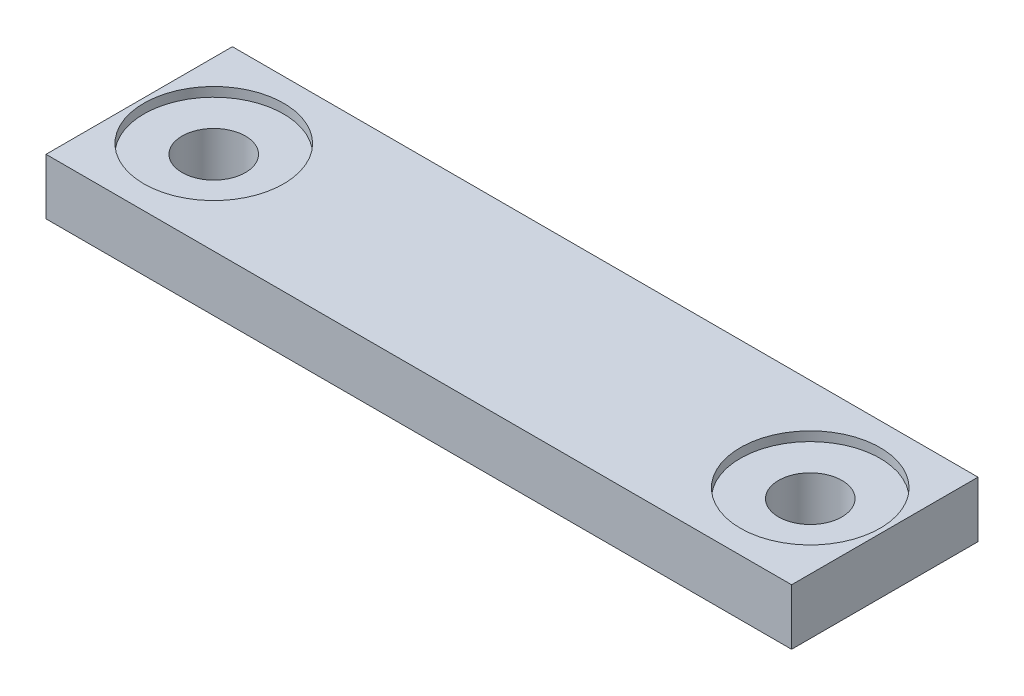
ISO-10303-21;
HEADER;
FILE_DESCRIPTION(('STEP AP214'),'2;1');
FILE_NAME('part.step','',(''),(''),'','','');
FILE_SCHEMA(('AUTOMOTIVE_DESIGN { 1 0 10303 214 1 1 1 1 }'));
ENDSEC;
DATA;
#1=APPLICATION_CONTEXT('core data for automotive mechanical design processes');
#2=APPLICATION_PROTOCOL_DEFINITION('international standard','automotive_design',2000,#1);
#3=PRODUCT_CONTEXT('',#1,'mechanical');
#4=PRODUCT('Part','Part','',(#3));
#5=PRODUCT_RELATED_PRODUCT_CATEGORY('part','',(#4));
#6=PRODUCT_DEFINITION_FORMATION('','',#4);
#7=PRODUCT_DEFINITION_CONTEXT('part definition',#1,'design');
#8=PRODUCT_DEFINITION('design','',#6,#7);
#9=PRODUCT_DEFINITION_SHAPE('','',#8);
#10=(LENGTH_UNIT() NAMED_UNIT(*) SI_UNIT(.MILLI.,.METRE.));
#11=(NAMED_UNIT(*) PLANE_ANGLE_UNIT() SI_UNIT($,.RADIAN.));
#12=(NAMED_UNIT(*) SI_UNIT($,.STERADIAN.) SOLID_ANGLE_UNIT());
#13=UNCERTAINTY_MEASURE_WITH_UNIT(LENGTH_MEASURE(1.E-05),#10,'distance_accuracy_value','');
#14=(GEOMETRIC_REPRESENTATION_CONTEXT(3) GLOBAL_UNCERTAINTY_ASSIGNED_CONTEXT((#13)) GLOBAL_UNIT_ASSIGNED_CONTEXT((#10,
#11,#12)) REPRESENTATION_CONTEXT('',''));
#15=CARTESIAN_POINT('',(0.,0.,0.));
#16=DIRECTION('',(0.,0.,1.));
#17=DIRECTION('',(1.,0.,0.));
#18=AXIS2_PLACEMENT_3D('',#15,#16,#17);
#19=CARTESIAN_POINT('',(0.,-3.,0.));
#20=DIRECTION('',(-1.,0.,0.));
#21=DIRECTION('',(0.,0.,1.));
#22=AXIS2_PLACEMENT_3D('',#19,#20,#21);
#23=PLANE('',#22);
#24=DIRECTION('',(0.,0.,1.));
#25=VECTOR('',#24,1.);
#26=CARTESIAN_POINT('',(0.,0.,0.));
#27=LINE('',#26,#25);
#28=CARTESIAN_POINT('',(0.,0.,0.));
#29=VERTEX_POINT('',#28);
#30=CARTESIAN_POINT('',(0.,0.,10.));
#31=VERTEX_POINT('',#30);
#32=EDGE_CURVE('E110',#29,#31,#27,.T.);
#33=ORIENTED_EDGE('',*,*,#32,.F.);
#34=DIRECTION('',(0.,1.,0.));
#35=VECTOR('',#34,1.);
#36=CARTESIAN_POINT('',(0.,-3.,0.));
#37=LINE('',#36,#35);
#38=CARTESIAN_POINT('',(0.,-3.,0.));
#39=VERTEX_POINT('',#38);
#40=EDGE_CURVE('E11',#39,#29,#37,.T.);
#41=ORIENTED_EDGE('',*,*,#40,.F.);
#42=DIRECTION('',(0.,0.,1.));
#43=VECTOR('',#42,1.);
#44=CARTESIAN_POINT('',(0.,-3.,0.));
#45=LINE('',#44,#43);
#46=CARTESIAN_POINT('',(0.,-3.,10.));
#47=VERTEX_POINT('',#46);
#48=EDGE_CURVE('E101',#39,#47,#45,.T.);
#49=ORIENTED_EDGE('',*,*,#48,.T.);
#50=DIRECTION('',(0.,1.,0.));
#51=VECTOR('',#50,1.);
#52=CARTESIAN_POINT('',(0.,-3.,10.));
#53=LINE('',#52,#51);
#54=EDGE_CURVE('E42',#47,#31,#53,.T.);
#55=ORIENTED_EDGE('',*,*,#54,.T.);
#56=EDGE_LOOP('',(#33,#41,#49,#55));
#57=FACE_BOUND('',#56,.T.);
#58=ADVANCED_FACE('F39',(#57),#23,.T.);
#59=CARTESIAN_POINT('',(0.,-3.,0.));
#60=DIRECTION('',(0.,0.,-1.));
#61=DIRECTION('',(-1.,0.,0.));
#62=AXIS2_PLACEMENT_3D('',#59,#60,#61);
#63=PLANE('',#62);
#64=DIRECTION('',(-1.,0.,0.));
#65=VECTOR('',#64,1.);
#66=CARTESIAN_POINT('',(0.,0.,0.));
#67=LINE('',#66,#65);
#68=CARTESIAN_POINT('',(40.,0.,0.));
#69=VERTEX_POINT('',#68);
#70=EDGE_CURVE('E104',#69,#29,#67,.T.);
#71=ORIENTED_EDGE('',*,*,#70,.F.);
#72=DIRECTION('',(0.,1.,0.));
#73=VECTOR('',#72,1.);
#74=CARTESIAN_POINT('',(40.,-3.,0.));
#75=LINE('',#74,#73);
#76=CARTESIAN_POINT('',(40.,-3.,0.));
#77=VERTEX_POINT('',#76);
#78=EDGE_CURVE('E49',#77,#69,#75,.T.);
#79=ORIENTED_EDGE('',*,*,#78,.F.);
#80=DIRECTION('',(-1.,0.,0.));
#81=VECTOR('',#80,1.);
#82=CARTESIAN_POINT('',(0.,-3.,0.));
#83=LINE('',#82,#81);
#84=EDGE_CURVE('E96',#77,#39,#83,.T.);
#85=ORIENTED_EDGE('',*,*,#84,.T.);
#86=ORIENTED_EDGE('',*,*,#40,.T.);
#87=EDGE_LOOP('',(#71,#79,#85,#86));
#88=FACE_BOUND('',#87,.T.);
#89=ADVANCED_FACE('F127',(#88),#63,.T.);
#90=CARTESIAN_POINT('',(40.,-3.,0.));
#91=DIRECTION('',(1.,0.,0.));
#92=DIRECTION('',(0.,0.,-1.));
#93=AXIS2_PLACEMENT_3D('',#90,#91,#92);
#94=PLANE('',#93);
#95=DIRECTION('',(0.,0.,-1.));
#96=VECTOR('',#95,1.);
#97=CARTESIAN_POINT('',(40.,0.,0.));
#98=LINE('',#97,#96);
#99=CARTESIAN_POINT('',(40.,0.,10.));
#100=VERTEX_POINT('',#99);
#101=EDGE_CURVE('E90',#100,#69,#98,.T.);
#102=ORIENTED_EDGE('',*,*,#101,.F.);
#103=DIRECTION('',(0.,1.,0.));
#104=VECTOR('',#103,1.);
#105=CARTESIAN_POINT('',(40.,-3.,10.));
#106=LINE('',#105,#104);
#107=CARTESIAN_POINT('',(40.,-3.,10.));
#108=VERTEX_POINT('',#107);
#109=EDGE_CURVE('E85',#108,#100,#106,.T.);
#110=ORIENTED_EDGE('',*,*,#109,.F.);
#111=DIRECTION('',(0.,0.,-1.));
#112=VECTOR('',#111,1.);
#113=CARTESIAN_POINT('',(40.,-3.,0.));
#114=LINE('',#113,#112);
#115=EDGE_CURVE('E88',#108,#77,#114,.T.);
#116=ORIENTED_EDGE('',*,*,#115,.T.);
#117=ORIENTED_EDGE('',*,*,#78,.T.);
#118=EDGE_LOOP('',(#102,#110,#116,#117));
#119=FACE_BOUND('',#118,.T.);
#120=ADVANCED_FACE('F87',(#119),#94,.T.);
#121=CARTESIAN_POINT('',(0.,-3.,10.));
#122=DIRECTION('',(0.,0.,1.));
#123=DIRECTION('',(1.,0.,0.));
#124=AXIS2_PLACEMENT_3D('',#121,#122,#123);
#125=PLANE('',#124);
#126=DIRECTION('',(1.,0.,0.));
#127=VECTOR('',#126,1.);
#128=CARTESIAN_POINT('',(0.,0.,10.));
#129=LINE('',#128,#127);
#130=EDGE_CURVE('E114',#31,#100,#129,.T.);
#131=ORIENTED_EDGE('',*,*,#130,.F.);
#132=ORIENTED_EDGE('',*,*,#54,.F.);
#133=DIRECTION('',(1.,0.,0.));
#134=VECTOR('',#133,1.);
#135=CARTESIAN_POINT('',(0.,-3.,10.));
#136=LINE('',#135,#134);
#137=EDGE_CURVE('E95',#47,#108,#136,.T.);
#138=ORIENTED_EDGE('',*,*,#137,.T.);
#139=ORIENTED_EDGE('',*,*,#109,.T.);
#140=EDGE_LOOP('',(#131,#132,#138,#139));
#141=FACE_BOUND('',#140,.T.);
#142=ADVANCED_FACE('F99',(#141),#125,.T.);
#143=CARTESIAN_POINT('',(0.,-3.,0.));
#144=DIRECTION('',(0.,1.,0.));
#145=DIRECTION('',(0.,0.,1.));
#146=AXIS2_PLACEMENT_3D('',#143,#144,#145);
#147=PLANE('',#146);
#148=CARTESIAN_POINT('',(4.,-3.,5.00000000000001));
#149=DIRECTION('',(0.,1.,0.));
#150=DIRECTION('',(0.,0.,1.));
#151=AXIS2_PLACEMENT_3D('',#148,#149,#150);
#152=CIRCLE('',#151,1.7);
#153=CARTESIAN_POINT('',(4.,-3.,6.7));
#154=VERTEX_POINT('',#153);
#155=EDGE_CURVE('E190',#154,#154,#152,.T.);
#156=ORIENTED_EDGE('',*,*,#155,.T.);
#157=EDGE_LOOP('',(#156));
#158=FACE_BOUND('',#157,.T.);
#159=CARTESIAN_POINT('',(36.,-3.,5.));
#160=DIRECTION('',(0.,1.,0.));
#161=DIRECTION('',(0.,0.,1.));
#162=AXIS2_PLACEMENT_3D('',#159,#160,#161);
#163=CIRCLE('',#162,1.7);
#164=CARTESIAN_POINT('',(36.,-3.,6.7));
#165=VERTEX_POINT('',#164);
#166=EDGE_CURVE('E115',#165,#165,#163,.T.);
#167=ORIENTED_EDGE('',*,*,#166,.T.);
#168=EDGE_LOOP('',(#167));
#169=FACE_BOUND('',#168,.T.);
#170=ORIENTED_EDGE('',*,*,#48,.F.);
#171=ORIENTED_EDGE('',*,*,#84,.F.);
#172=ORIENTED_EDGE('',*,*,#115,.F.);
#173=ORIENTED_EDGE('',*,*,#137,.F.);
#174=EDGE_LOOP('',(#170,#171,#172,#173));
#175=FACE_BOUND('',#174,.T.);
#176=ADVANCED_FACE('F94',(#158,#169,#175),#147,.F.);
#177=CARTESIAN_POINT('',(0.,0.,0.));
#178=DIRECTION('',(0.,1.,0.));
#179=DIRECTION('',(0.,0.,1.));
#180=AXIS2_PLACEMENT_3D('',#177,#178,#179);
#181=PLANE('',#180);
#182=CARTESIAN_POINT('',(4.,0.,5.00000000000001));
#183=DIRECTION('',(0.,1.,0.));
#184=DIRECTION('',(0.,0.,1.));
#185=AXIS2_PLACEMENT_3D('',#182,#183,#184);
#186=CIRCLE('',#185,3.75);
#187=CARTESIAN_POINT('',(4.,0.,8.75));
#188=VERTEX_POINT('',#187);
#189=EDGE_CURVE('E180',#188,#188,#186,.T.);
#190=ORIENTED_EDGE('',*,*,#189,.F.);
#191=EDGE_LOOP('',(#190));
#192=FACE_BOUND('',#191,.T.);
#193=CARTESIAN_POINT('',(36.,0.,5.));
#194=DIRECTION('',(0.,1.,0.));
#195=DIRECTION('',(0.,0.,1.));
#196=AXIS2_PLACEMENT_3D('',#193,#194,#195);
#197=CIRCLE('',#196,3.75);
#198=CARTESIAN_POINT('',(36.,0.,8.75));
#199=VERTEX_POINT('',#198);
#200=EDGE_CURVE('E193',#199,#199,#197,.T.);
#201=ORIENTED_EDGE('',*,*,#200,.F.);
#202=EDGE_LOOP('',(#201));
#203=FACE_BOUND('',#202,.T.);
#204=ORIENTED_EDGE('',*,*,#32,.T.);
#205=ORIENTED_EDGE('',*,*,#130,.T.);
#206=ORIENTED_EDGE('',*,*,#101,.T.);
#207=ORIENTED_EDGE('',*,*,#70,.T.);
#208=EDGE_LOOP('',(#204,#205,#206,#207));
#209=FACE_BOUND('',#208,.T.);
#210=ADVANCED_FACE('F126',(#192,#203,#209),#181,.T.);
#211=CARTESIAN_POINT('',(36.,0.,5.));
#212=DIRECTION('',(0.,1.,0.));
#213=DIRECTION('',(0.,0.,1.));
#214=AXIS2_PLACEMENT_3D('',#211,#212,#213);
#215=CYLINDRICAL_SURFACE('',#214,1.7);
#216=ORIENTED_EDGE('',*,*,#166,.F.);
#217=EDGE_LOOP('',(#216));
#218=FACE_BOUND('',#217,.T.);
#219=CARTESIAN_POINT('',(36.,-0.5,5.));
#220=DIRECTION('',(0.,1.,0.));
#221=DIRECTION('',(0.,0.,1.));
#222=AXIS2_PLACEMENT_3D('',#219,#220,#221);
#223=CIRCLE('',#222,1.7);
#224=CARTESIAN_POINT('',(36.,-0.5,6.7));
#225=VERTEX_POINT('',#224);
#226=EDGE_CURVE('E201',#225,#225,#223,.T.);
#227=ORIENTED_EDGE('',*,*,#226,.T.);
#228=EDGE_LOOP('',(#227));
#229=FACE_BOUND('',#228,.T.);
#230=ADVANCED_FACE('F145',(#218,#229),#215,.F.);
#231=CARTESIAN_POINT('',(37.7,-0.5,5.));
#232=DIRECTION('',(0.,-1.,0.));
#233=DIRECTION('',(0.,0.,-1.));
#234=AXIS2_PLACEMENT_3D('',#231,#232,#233);
#235=PLANE('',#234);
#236=ORIENTED_EDGE('',*,*,#226,.F.);
#237=EDGE_LOOP('',(#236));
#238=FACE_BOUND('',#237,.T.);
#239=CARTESIAN_POINT('',(36.,-0.5,5.));
#240=DIRECTION('',(0.,1.,0.));
#241=DIRECTION('',(0.,0.,1.));
#242=AXIS2_PLACEMENT_3D('',#239,#240,#241);
#243=CIRCLE('',#242,3.75);
#244=CARTESIAN_POINT('',(36.,-0.5,8.75));
#245=VERTEX_POINT('',#244);
#246=EDGE_CURVE('E197',#245,#245,#243,.T.);
#247=ORIENTED_EDGE('',*,*,#246,.T.);
#248=EDGE_LOOP('',(#247));
#249=FACE_BOUND('',#248,.T.);
#250=ADVANCED_FACE('F152',(#238,#249),#235,.F.);
#251=CARTESIAN_POINT('',(36.,0.,5.));
#252=DIRECTION('',(0.,1.,0.));
#253=DIRECTION('',(0.,0.,1.));
#254=AXIS2_PLACEMENT_3D('',#251,#252,#253);
#255=CYLINDRICAL_SURFACE('',#254,3.75);
#256=ORIENTED_EDGE('',*,*,#246,.F.);
#257=EDGE_LOOP('',(#256));
#258=FACE_BOUND('',#257,.T.);
#259=ORIENTED_EDGE('',*,*,#200,.T.);
#260=EDGE_LOOP('',(#259));
#261=FACE_BOUND('',#260,.T.);
#262=ADVANCED_FACE('F156',(#258,#261),#255,.F.);
#263=CARTESIAN_POINT('',(4.,0.,5.00000000000001));
#264=DIRECTION('',(0.,1.,0.));
#265=DIRECTION('',(0.,0.,1.));
#266=AXIS2_PLACEMENT_3D('',#263,#264,#265);
#267=CYLINDRICAL_SURFACE('',#266,1.7);
#268=ORIENTED_EDGE('',*,*,#155,.F.);
#269=EDGE_LOOP('',(#268));
#270=FACE_BOUND('',#269,.T.);
#271=CARTESIAN_POINT('',(4.,-0.5,5.00000000000001));
#272=DIRECTION('',(0.,1.,0.));
#273=DIRECTION('',(0.,0.,1.));
#274=AXIS2_PLACEMENT_3D('',#271,#272,#273);
#275=CIRCLE('',#274,1.7);
#276=CARTESIAN_POINT('',(4.,-0.5,6.7));
#277=VERTEX_POINT('',#276);
#278=EDGE_CURVE('E184',#277,#277,#275,.T.);
#279=ORIENTED_EDGE('',*,*,#278,.T.);
#280=EDGE_LOOP('',(#279));
#281=FACE_BOUND('',#280,.T.);
#282=ADVANCED_FACE('F160',(#270,#281),#267,.F.);
#283=CARTESIAN_POINT('',(5.7,-0.5,5.00000000000001));
#284=DIRECTION('',(0.,-1.,0.));
#285=DIRECTION('',(0.,0.,-1.));
#286=AXIS2_PLACEMENT_3D('',#283,#284,#285);
#287=PLANE('',#286);
#288=ORIENTED_EDGE('',*,*,#278,.F.);
#289=EDGE_LOOP('',(#288));
#290=FACE_BOUND('',#289,.T.);
#291=CARTESIAN_POINT('',(4.,-0.5,5.00000000000001));
#292=DIRECTION('',(0.,1.,0.));
#293=DIRECTION('',(0.,0.,1.));
#294=AXIS2_PLACEMENT_3D('',#291,#292,#293);
#295=CIRCLE('',#294,3.75);
#296=CARTESIAN_POINT('',(4.,-0.5,8.75));
#297=VERTEX_POINT('',#296);
#298=EDGE_CURVE('E177',#297,#297,#295,.T.);
#299=ORIENTED_EDGE('',*,*,#298,.T.);
#300=EDGE_LOOP('',(#299));
#301=FACE_BOUND('',#300,.T.);
#302=ADVANCED_FACE('F164',(#290,#301),#287,.F.);
#303=CARTESIAN_POINT('',(4.,0.,5.00000000000001));
#304=DIRECTION('',(0.,1.,0.));
#305=DIRECTION('',(0.,0.,1.));
#306=AXIS2_PLACEMENT_3D('',#303,#304,#305);
#307=CYLINDRICAL_SURFACE('',#306,3.75);
#308=ORIENTED_EDGE('',*,*,#298,.F.);
#309=EDGE_LOOP('',(#308));
#310=FACE_BOUND('',#309,.T.);
#311=ORIENTED_EDGE('',*,*,#189,.T.);
#312=EDGE_LOOP('',(#311));
#313=FACE_BOUND('',#312,.T.);
#314=ADVANCED_FACE('F168',(#310,#313),#307,.F.);
#315=CLOSED_SHELL('',(#58,#89,#120,#142,#176,#210,#230,#250,#262,#282,#302,#314));
#316=MANIFOLD_SOLID_BREP('B2',#315);
#317=ADVANCED_BREP_SHAPE_REPRESENTATION('',(#18,#316),#14);
#318=SHAPE_DEFINITION_REPRESENTATION(#9,#317);
ENDSEC;
END-ISO-10303-21;
